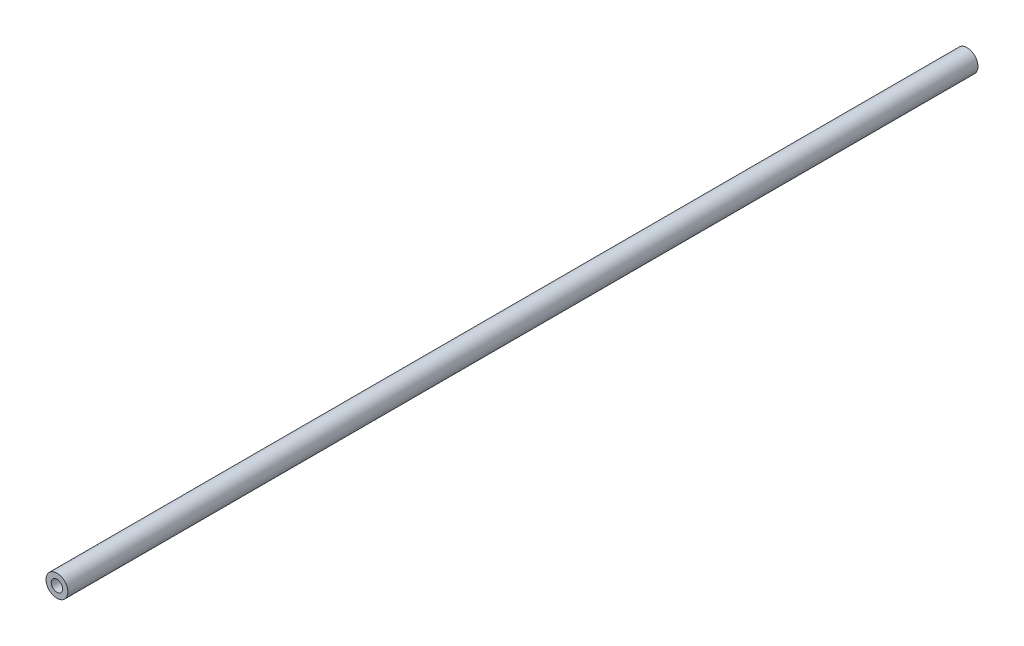
ISO-10303-21;
HEADER;
FILE_DESCRIPTION(('STEP AP214'),'2;1');
FILE_NAME('part.step','',(''),(''),'','','');
FILE_SCHEMA(('AUTOMOTIVE_DESIGN { 1 0 10303 214 1 1 1 1 }'));
ENDSEC;
DATA;
#1=APPLICATION_CONTEXT('core data for automotive mechanical design processes');
#2=APPLICATION_PROTOCOL_DEFINITION('international standard','automotive_design',2000,#1);
#3=PRODUCT_CONTEXT('',#1,'mechanical');
#4=PRODUCT('Part','Part','',(#3));
#5=PRODUCT_RELATED_PRODUCT_CATEGORY('part','',(#4));
#6=PRODUCT_DEFINITION_FORMATION('','',#4);
#7=PRODUCT_DEFINITION_CONTEXT('part definition',#1,'design');
#8=PRODUCT_DEFINITION('design','',#6,#7);
#9=PRODUCT_DEFINITION_SHAPE('','',#8);
#10=(LENGTH_UNIT() NAMED_UNIT(*) SI_UNIT(.MILLI.,.METRE.));
#11=(NAMED_UNIT(*) PLANE_ANGLE_UNIT() SI_UNIT($,.RADIAN.));
#12=(NAMED_UNIT(*) SI_UNIT($,.STERADIAN.) SOLID_ANGLE_UNIT());
#13=UNCERTAINTY_MEASURE_WITH_UNIT(LENGTH_MEASURE(1.E-05),#10,'distance_accuracy_value','');
#14=(GEOMETRIC_REPRESENTATION_CONTEXT(3) GLOBAL_UNCERTAINTY_ASSIGNED_CONTEXT((#13)) GLOBAL_UNIT_ASSIGNED_CONTEXT((#10,
#11,#12)) REPRESENTATION_CONTEXT('',''));
#15=CARTESIAN_POINT('',(0.,0.,0.));
#16=DIRECTION('',(0.,0.,1.));
#17=DIRECTION('',(1.,0.,0.));
#18=AXIS2_PLACEMENT_3D('',#15,#16,#17);
#19=CARTESIAN_POINT('',(0.,0.,508.));
#20=DIRECTION('',(0.,0.,1.));
#21=DIRECTION('',(1.,0.,0.));
#22=AXIS2_PLACEMENT_3D('',#19,#20,#21);
#23=PLANE('',#22);
#24=CARTESIAN_POINT('',(0.,0.,508.));
#25=DIRECTION('',(0.,0.,1.));
#26=DIRECTION('',(1.,0.,0.));
#27=AXIS2_PLACEMENT_3D('',#24,#25,#26);
#28=CIRCLE('',#27,6.096);
#29=CARTESIAN_POINT('',(6.096,0.,508.));
#30=VERTEX_POINT('',#29);
#31=EDGE_CURVE('E10',#30,#30,#28,.T.);
#32=ORIENTED_EDGE('',*,*,#31,.T.);
#33=EDGE_LOOP('',(#32));
#34=FACE_BOUND('',#33,.T.);
#35=CARTESIAN_POINT('',(0.,0.,508.));
#36=DIRECTION('',(0.,0.,1.));
#37=DIRECTION('',(1.,0.,0.));
#38=AXIS2_PLACEMENT_3D('',#35,#36,#37);
#39=CIRCLE('',#38,3.175);
#40=CARTESIAN_POINT('',(3.175,0.,508.));
#41=VERTEX_POINT('',#40);
#42=EDGE_CURVE('E46',#41,#41,#39,.T.);
#43=ORIENTED_EDGE('',*,*,#42,.F.);
#44=EDGE_LOOP('',(#43));
#45=FACE_BOUND('',#44,.T.);
#46=ADVANCED_FACE('F35',(#34,#45),#23,.T.);
#47=CARTESIAN_POINT('',(0.,0.,0.));
#48=DIRECTION('',(0.,0.,1.));
#49=DIRECTION('',(1.,0.,0.));
#50=AXIS2_PLACEMENT_3D('',#47,#48,#49);
#51=PLANE('',#50);
#52=CARTESIAN_POINT('',(0.,0.,0.));
#53=DIRECTION('',(0.,0.,1.));
#54=DIRECTION('',(1.,0.,0.));
#55=AXIS2_PLACEMENT_3D('',#52,#53,#54);
#56=CIRCLE('',#55,6.096);
#57=CARTESIAN_POINT('',(6.096,0.,0.));
#58=VERTEX_POINT('',#57);
#59=EDGE_CURVE('E39',#58,#58,#56,.T.);
#60=ORIENTED_EDGE('',*,*,#59,.F.);
#61=EDGE_LOOP('',(#60));
#62=FACE_BOUND('',#61,.T.);
#63=CARTESIAN_POINT('',(0.,0.,0.));
#64=DIRECTION('',(0.,0.,1.));
#65=DIRECTION('',(1.,0.,0.));
#66=AXIS2_PLACEMENT_3D('',#63,#64,#65);
#67=CIRCLE('',#66,3.175);
#68=CARTESIAN_POINT('',(3.175,0.,0.));
#69=VERTEX_POINT('',#68);
#70=EDGE_CURVE('E48',#69,#69,#67,.T.);
#71=ORIENTED_EDGE('',*,*,#70,.T.);
#72=EDGE_LOOP('',(#71));
#73=FACE_BOUND('',#72,.T.);
#74=ADVANCED_FACE('F58',(#62,#73),#51,.F.);
#75=CARTESIAN_POINT('',(0.,0.,508.));
#76=DIRECTION('',(0.,0.,-1.));
#77=DIRECTION('',(-1.,0.,0.));
#78=AXIS2_PLACEMENT_3D('',#75,#76,#77);
#79=CYLINDRICAL_SURFACE('',#78,6.096);
#80=ORIENTED_EDGE('',*,*,#31,.F.);
#81=EDGE_LOOP('',(#80));
#82=FACE_BOUND('',#81,.T.);
#83=ORIENTED_EDGE('',*,*,#59,.T.);
#84=EDGE_LOOP('',(#83));
#85=FACE_BOUND('',#84,.T.);
#86=ADVANCED_FACE('F37',(#82,#85),#79,.T.);
#87=CARTESIAN_POINT('',(0.,0.,508.));
#88=DIRECTION('',(0.,0.,-1.));
#89=DIRECTION('',(-1.,0.,0.));
#90=AXIS2_PLACEMENT_3D('',#87,#88,#89);
#91=CYLINDRICAL_SURFACE('',#90,3.175);
#92=ORIENTED_EDGE('',*,*,#42,.T.);
#93=EDGE_LOOP('',(#92));
#94=FACE_BOUND('',#93,.T.);
#95=ORIENTED_EDGE('',*,*,#70,.F.);
#96=EDGE_LOOP('',(#95));
#97=FACE_BOUND('',#96,.T.);
#98=ADVANCED_FACE('F54',(#94,#97),#91,.F.);
#99=CLOSED_SHELL('',(#46,#74,#86,#98));
#100=MANIFOLD_SOLID_BREP('B2',#99);
#101=ADVANCED_BREP_SHAPE_REPRESENTATION('',(#18,#100),#14);
#102=SHAPE_DEFINITION_REPRESENTATION(#9,#101);
ENDSEC;
END-ISO-10303-21;
